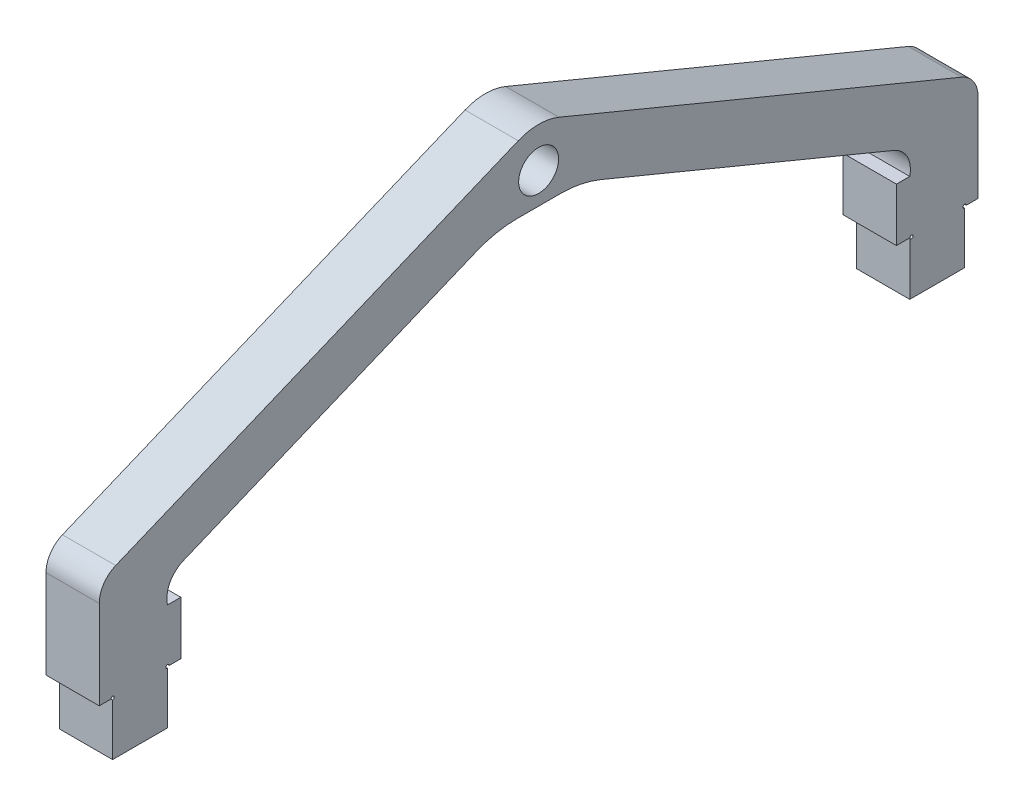
ISO-10303-21;
HEADER;
FILE_DESCRIPTION(('STEP AP214'),'2;1');
FILE_NAME('part.step','',(''),(''),'','','');
FILE_SCHEMA(('AUTOMOTIVE_DESIGN { 1 0 10303 214 1 1 1 1 }'));
ENDSEC;
DATA;
#1=APPLICATION_CONTEXT('core data for automotive mechanical design processes');
#2=APPLICATION_PROTOCOL_DEFINITION('international standard','automotive_design',2000,#1);
#3=PRODUCT_CONTEXT('',#1,'mechanical');
#4=PRODUCT('Part','Part','',(#3));
#5=PRODUCT_RELATED_PRODUCT_CATEGORY('part','',(#4));
#6=PRODUCT_DEFINITION_FORMATION('','',#4);
#7=PRODUCT_DEFINITION_CONTEXT('part definition',#1,'design');
#8=PRODUCT_DEFINITION('design','',#6,#7);
#9=PRODUCT_DEFINITION_SHAPE('','',#8);
#10=(LENGTH_UNIT() NAMED_UNIT(*) SI_UNIT(.MILLI.,.METRE.));
#11=(NAMED_UNIT(*) PLANE_ANGLE_UNIT() SI_UNIT($,.RADIAN.));
#12=(NAMED_UNIT(*) SI_UNIT($,.STERADIAN.) SOLID_ANGLE_UNIT());
#13=UNCERTAINTY_MEASURE_WITH_UNIT(LENGTH_MEASURE(1.E-05),#10,'distance_accuracy_value','');
#14=(GEOMETRIC_REPRESENTATION_CONTEXT(3) GLOBAL_UNCERTAINTY_ASSIGNED_CONTEXT((#13)) GLOBAL_UNIT_ASSIGNED_CONTEXT((#10,
#11,#12)) REPRESENTATION_CONTEXT('',''));
#15=CARTESIAN_POINT('',(0.,0.,0.));
#16=DIRECTION('',(0.,0.,1.));
#17=DIRECTION('',(1.,0.,0.));
#18=AXIS2_PLACEMENT_3D('',#15,#16,#17);
#19=CARTESIAN_POINT('',(6.35,29.3518274111675,-12.1455837563452));
#20=DIRECTION('',(0.,0.924016832421891,-0.3823517927263));
#21=DIRECTION('',(0.,0.3823517927263,0.924016832421891));
#22=AXIS2_PLACEMENT_3D('',#19,#20,#21);
#23=PLANE('',#22);
#24=DIRECTION('',(0.,-0.3823517927263,-0.924016832421891));
#25=VECTOR('',#24,1.);
#26=CARTESIAN_POINT('',(0.,29.3518274111675,-12.1455837563452));
#27=LINE('',#26,#25);
#28=CARTESIAN_POINT('',(0.,33.3729239101468,-2.427933883812));
#29=VERTEX_POINT('',#28);
#30=CARTESIAN_POINT('',(0.,13.5114619550734,-50.426466941906));
#31=VERTEX_POINT('',#30);
#32=EDGE_CURVE('E372',#29,#31,#27,.T.);
#33=ORIENTED_EDGE('',*,*,#32,.F.);
#34=DIRECTION('',(-1.,0.,0.));
#35=VECTOR('',#34,1.);
#36=CARTESIAN_POINT('',(6.35,33.3729239101468,-2.427933883812));
#37=LINE('',#36,#35);
#38=CARTESIAN_POINT('',(6.35,33.3729239101468,-2.427933883812));
#39=VERTEX_POINT('',#38);
#40=EDGE_CURVE('E42',#29,#39,#37,.F.);
#41=ORIENTED_EDGE('',*,*,#40,.T.);
#42=DIRECTION('',(0.,-0.3823517927263,-0.924016832421891));
#43=VECTOR('',#42,1.);
#44=CARTESIAN_POINT('',(6.35,29.3518274111675,-12.1455837563452));
#45=LINE('',#44,#43);
#46=CARTESIAN_POINT('',(6.35,13.5114619550734,-50.426466941906));
#47=VERTEX_POINT('',#46);
#48=EDGE_CURVE('E261',#39,#47,#45,.T.);
#49=ORIENTED_EDGE('',*,*,#48,.T.);
#50=DIRECTION('',(-1.,0.,0.));
#51=VECTOR('',#50,1.);
#52=CARTESIAN_POINT('',(0.,13.5114619550734,-50.426466941906));
#53=LINE('',#52,#51);
#54=EDGE_CURVE('E309',#47,#31,#53,.T.);
#55=ORIENTED_EDGE('',*,*,#54,.T.);
#56=EDGE_LOOP('',(#33,#41,#49,#55));
#57=FACE_BOUND('',#56,.T.);
#58=ADVANCED_FACE('F34',(#57),#23,.T.);
#59=CARTESIAN_POINT('',(6.35,29.3518274111675,12.1455837563452));
#60=DIRECTION('',(0.,0.924016832421891,0.3823517927263));
#61=DIRECTION('',(0.,-0.3823517927263,0.924016832421891));
#62=AXIS2_PLACEMENT_3D('',#59,#60,#61);
#63=PLANE('',#62);
#64=DIRECTION('',(0.,0.3823517927263,-0.924016832421891));
#65=VECTOR('',#64,1.);
#66=CARTESIAN_POINT('',(6.35,29.3518274111675,12.1455837563452));
#67=LINE('',#66,#65);
#68=CARTESIAN_POINT('',(6.35,13.5114619550733,50.426466941906));
#69=VERTEX_POINT('',#68);
#70=CARTESIAN_POINT('',(6.35,33.3729239101468,2.427933883812));
#71=VERTEX_POINT('',#70);
#72=EDGE_CURVE('E367',#69,#71,#67,.T.);
#73=ORIENTED_EDGE('',*,*,#72,.T.);
#74=DIRECTION('',(-1.,0.,0.));
#75=VECTOR('',#74,1.);
#76=CARTESIAN_POINT('',(6.35,33.3729239101468,2.42793388381201));
#77=LINE('',#76,#75);
#78=CARTESIAN_POINT('',(0.,33.3729239101468,2.427933883812));
#79=VERTEX_POINT('',#78);
#80=EDGE_CURVE('E356',#71,#79,#77,.T.);
#81=ORIENTED_EDGE('',*,*,#80,.T.);
#82=DIRECTION('',(0.,0.3823517927263,-0.924016832421891));
#83=VECTOR('',#82,1.);
#84=CARTESIAN_POINT('',(0.,29.3518274111675,12.1455837563452));
#85=LINE('',#84,#83);
#86=CARTESIAN_POINT('',(0.,13.5114619550733,50.426466941906));
#87=VERTEX_POINT('',#86);
#88=EDGE_CURVE('E364',#87,#79,#85,.T.);
#89=ORIENTED_EDGE('',*,*,#88,.F.);
#90=DIRECTION('',(-1.,0.,0.));
#91=VECTOR('',#90,1.);
#92=CARTESIAN_POINT('',(6.35,13.5114619550733,50.426466941906));
#93=LINE('',#92,#91);
#94=EDGE_CURVE('E326',#87,#69,#93,.F.);
#95=ORIENTED_EDGE('',*,*,#94,.T.);
#96=EDGE_LOOP('',(#73,#81,#89,#95));
#97=FACE_BOUND('',#96,.T.);
#98=ADVANCED_FACE('F363',(#97),#63,.T.);
#99=CARTESIAN_POINT('',(6.35,0.,52.3875));
#100=DIRECTION('',(0.,0.,1.));
#101=DIRECTION('',(1.,0.,0.));
#102=AXIS2_PLACEMENT_3D('',#99,#100,#101);
#103=PLANE('',#102);
#104=DIRECTION('',(0.,1.,0.));
#105=VECTOR('',#104,1.);
#106=CARTESIAN_POINT('',(6.35,0.,52.3875));
#107=LINE('',#106,#105);
#108=CARTESIAN_POINT('',(6.35,0.,52.3875));
#109=VERTEX_POINT('',#108);
#110=CARTESIAN_POINT('',(6.35,10.5777085121338,52.3875));
#111=VERTEX_POINT('',#110);
#112=EDGE_CURVE('E519',#109,#111,#107,.T.);
#113=ORIENTED_EDGE('',*,*,#112,.T.);
#114=DIRECTION('',(-1.,0.,0.));
#115=VECTOR('',#114,1.);
#116=CARTESIAN_POINT('',(6.35,10.5777085121338,52.3875));
#117=LINE('',#116,#115);
#118=CARTESIAN_POINT('',(0.,10.5777085121338,52.3875));
#119=VERTEX_POINT('',#118);
#120=EDGE_CURVE('E323',#111,#119,#117,.T.);
#121=ORIENTED_EDGE('',*,*,#120,.T.);
#122=DIRECTION('',(0.,1.,0.));
#123=VECTOR('',#122,1.);
#124=CARTESIAN_POINT('',(0.,0.,52.3875));
#125=LINE('',#124,#123);
#126=CARTESIAN_POINT('',(0.,0.,52.3875));
#127=VERTEX_POINT('',#126);
#128=EDGE_CURVE('E371',#127,#119,#125,.T.);
#129=ORIENTED_EDGE('',*,*,#128,.F.);
#130=DIRECTION('',(-1.,0.,0.));
#131=VECTOR('',#130,1.);
#132=CARTESIAN_POINT('',(6.35,0.,52.3875));
#133=LINE('',#132,#131);
#134=EDGE_CURVE('E299',#109,#127,#133,.T.);
#135=ORIENTED_EDGE('',*,*,#134,.F.);
#136=EDGE_LOOP('',(#113,#121,#129,#135));
#137=FACE_BOUND('',#136,.T.);
#138=ADVANCED_FACE('F571',(#137),#103,.T.);
#139=CARTESIAN_POINT('',(6.35,-4.48275926204392E-13,0.));
#140=DIRECTION('',(0.,-1.,0.));
#141=DIRECTION('',(0.,0.,-1.));
#142=AXIS2_PLACEMENT_3D('',#139,#140,#141);
#143=PLANE('',#142);
#144=DIRECTION('',(1.,0.,0.));
#145=VECTOR('',#144,1.);
#146=CARTESIAN_POINT('',(0.,0.,50.9984375));
#147=LINE('',#146,#145);
#148=CARTESIAN_POINT('',(6.35,0.,50.9984375));
#149=VERTEX_POINT('',#148);
#150=CARTESIAN_POINT('',(0.,0.,50.9984375));
#151=VERTEX_POINT('',#150);
#152=EDGE_CURVE('E376',#149,#151,#147,.F.);
#153=ORIENTED_EDGE('',*,*,#152,.F.);
#154=DIRECTION('',(0.,0.,1.));
#155=VECTOR('',#154,1.);
#156=CARTESIAN_POINT('',(6.35,-4.48275926204392E-13,0.));
#157=LINE('',#156,#155);
#158=EDGE_CURVE('E522',#149,#109,#157,.T.);
#159=ORIENTED_EDGE('',*,*,#158,.T.);
#160=ORIENTED_EDGE('',*,*,#134,.T.);
#161=DIRECTION('',(0.,0.,1.));
#162=VECTOR('',#161,1.);
#163=CARTESIAN_POINT('',(0.,-4.48275926204392E-13,0.));
#164=LINE('',#163,#162);
#165=EDGE_CURVE('E374',#151,#127,#164,.T.);
#166=ORIENTED_EDGE('',*,*,#165,.F.);
#167=EDGE_LOOP('',(#153,#159,#160,#166));
#168=FACE_BOUND('',#167,.T.);
#169=ADVANCED_FACE('F802',(#168),#143,.T.);
#170=CARTESIAN_POINT('',(6.35,0.,50.8));
#171=DIRECTION('',(0.,0.,-1.));
#172=DIRECTION('',(-1.,0.,0.));
#173=AXIS2_PLACEMENT_3D('',#170,#171,#172);
#174=PLANE('',#173);
#175=DIRECTION('',(0.,-1.,0.));
#176=VECTOR('',#175,1.);
#177=CARTESIAN_POINT('',(6.35,0.,50.8));
#178=LINE('',#177,#176);
#179=CARTESIAN_POINT('',(6.35,-0.198437500000019,50.8));
#180=VERTEX_POINT('',#179);
#181=CARTESIAN_POINT('',(6.35,-6.35000000000001,50.8));
#182=VERTEX_POINT('',#181);
#183=EDGE_CURVE('E524',#180,#182,#178,.T.);
#184=ORIENTED_EDGE('',*,*,#183,.F.);
#185=DIRECTION('',(1.,0.,0.));
#186=VECTOR('',#185,1.);
#187=CARTESIAN_POINT('',(0.,-0.198437500000019,50.8));
#188=LINE('',#187,#186);
#189=CARTESIAN_POINT('',(0.,-0.198437500000019,50.8));
#190=VERTEX_POINT('',#189);
#191=EDGE_CURVE('E513',#180,#190,#188,.F.);
#192=ORIENTED_EDGE('',*,*,#191,.T.);
#193=DIRECTION('',(0.,-1.,0.));
#194=VECTOR('',#193,1.);
#195=CARTESIAN_POINT('',(0.,0.,50.8));
#196=LINE('',#195,#194);
#197=CARTESIAN_POINT('',(0.,-6.35000000000001,50.8));
#198=VERTEX_POINT('',#197);
#199=EDGE_CURVE('E381',#190,#198,#196,.T.);
#200=ORIENTED_EDGE('',*,*,#199,.T.);
#201=DIRECTION('',(-1.,0.,0.));
#202=VECTOR('',#201,1.);
#203=CARTESIAN_POINT('',(6.35,-6.35000000000001,50.8));
#204=LINE('',#203,#202);
#205=EDGE_CURVE('E296',#182,#198,#204,.T.);
#206=ORIENTED_EDGE('',*,*,#205,.F.);
#207=EDGE_LOOP('',(#184,#192,#200,#206));
#208=FACE_BOUND('',#207,.T.);
#209=ADVANCED_FACE('F798',(#208),#174,.F.);
#210=CARTESIAN_POINT('',(6.35,-6.34999999999992,0.));
#211=DIRECTION('',(0.,1.,0.));
#212=DIRECTION('',(0.,0.,1.));
#213=AXIS2_PLACEMENT_3D('',#210,#211,#212);
#214=PLANE('',#213);
#215=DIRECTION('',(0.,0.,-1.));
#216=VECTOR('',#215,1.);
#217=CARTESIAN_POINT('',(0.,-6.34999999999992,0.));
#218=LINE('',#217,#216);
#219=CARTESIAN_POINT('',(0.,-6.35,44.25));
#220=VERTEX_POINT('',#219);
#221=EDGE_CURVE('E383',#198,#220,#218,.T.);
#222=ORIENTED_EDGE('',*,*,#221,.T.);
#223=DIRECTION('',(-1.,0.,0.));
#224=VECTOR('',#223,1.);
#225=CARTESIAN_POINT('',(6.35,-6.35,44.25));
#226=LINE('',#225,#224);
#227=CARTESIAN_POINT('',(6.35,-6.35,44.25));
#228=VERTEX_POINT('',#227);
#229=EDGE_CURVE('E293',#228,#220,#226,.T.);
#230=ORIENTED_EDGE('',*,*,#229,.F.);
#231=DIRECTION('',(0.,0.,-1.));
#232=VECTOR('',#231,1.);
#233=CARTESIAN_POINT('',(6.35,-6.34999999999992,0.));
#234=LINE('',#233,#232);
#235=EDGE_CURVE('E526',#182,#228,#234,.T.);
#236=ORIENTED_EDGE('',*,*,#235,.F.);
#237=ORIENTED_EDGE('',*,*,#205,.T.);
#238=EDGE_LOOP('',(#222,#230,#236,#237));
#239=FACE_BOUND('',#238,.T.);
#240=ADVANCED_FACE('F794',(#239),#214,.F.);
#241=CARTESIAN_POINT('',(6.35,0.,44.25));
#242=DIRECTION('',(0.,0.,-1.));
#243=DIRECTION('',(-1.,0.,0.));
#244=AXIS2_PLACEMENT_3D('',#241,#242,#243);
#245=PLANE('',#244);
#246=DIRECTION('',(1.,0.,0.));
#247=VECTOR('',#246,1.);
#248=CARTESIAN_POINT('',(0.,-0.1984375,44.25));
#249=LINE('',#248,#247);
#250=CARTESIAN_POINT('',(6.35,-0.1984375,44.25));
#251=VERTEX_POINT('',#250);
#252=CARTESIAN_POINT('',(0.,-0.1984375,44.25));
#253=VERTEX_POINT('',#252);
#254=EDGE_CURVE('E504',#251,#253,#249,.F.);
#255=ORIENTED_EDGE('',*,*,#254,.F.);
#256=DIRECTION('',(0.,-1.,0.));
#257=VECTOR('',#256,1.);
#258=CARTESIAN_POINT('',(6.35,0.,44.25));
#259=LINE('',#258,#257);
#260=EDGE_CURVE('E529',#251,#228,#259,.T.);
#261=ORIENTED_EDGE('',*,*,#260,.T.);
#262=ORIENTED_EDGE('',*,*,#229,.T.);
#263=DIRECTION('',(0.,-1.,0.));
#264=VECTOR('',#263,1.);
#265=CARTESIAN_POINT('',(0.,0.,44.25));
#266=LINE('',#265,#264);
#267=EDGE_CURVE('E386',#253,#220,#266,.T.);
#268=ORIENTED_EDGE('',*,*,#267,.F.);
#269=EDGE_LOOP('',(#255,#261,#262,#268));
#270=FACE_BOUND('',#269,.T.);
#271=ADVANCED_FACE('F791',(#270),#245,.T.);
#272=CARTESIAN_POINT('',(6.35,0.,0.));
#273=DIRECTION('',(0.,1.,0.));
#274=DIRECTION('',(0.,0.,1.));
#275=AXIS2_PLACEMENT_3D('',#272,#273,#274);
#276=PLANE('',#275);
#277=DIRECTION('',(0.,0.,-1.));
#278=VECTOR('',#277,1.);
#279=CARTESIAN_POINT('',(6.35,0.,0.));
#280=LINE('',#279,#278);
#281=CARTESIAN_POINT('',(6.35,0.,44.0515625));
#282=VERTEX_POINT('',#281);
#283=CARTESIAN_POINT('',(6.35,0.,42.6625));
#284=VERTEX_POINT('',#283);
#285=EDGE_CURVE('E501',#282,#284,#280,.T.);
#286=ORIENTED_EDGE('',*,*,#285,.F.);
#287=DIRECTION('',(1.,0.,0.));
#288=VECTOR('',#287,1.);
#289=CARTESIAN_POINT('',(0.,0.,44.0515625));
#290=LINE('',#289,#288);
#291=CARTESIAN_POINT('',(0.,0.,44.0515625));
#292=VERTEX_POINT('',#291);
#293=EDGE_CURVE('E500',#282,#292,#290,.F.);
#294=ORIENTED_EDGE('',*,*,#293,.T.);
#295=DIRECTION('',(0.,0.,-1.));
#296=VECTOR('',#295,1.);
#297=CARTESIAN_POINT('',(0.,0.,0.));
#298=LINE('',#297,#296);
#299=CARTESIAN_POINT('',(0.,0.,42.6625));
#300=VERTEX_POINT('',#299);
#301=EDGE_CURVE('E388',#292,#300,#298,.T.);
#302=ORIENTED_EDGE('',*,*,#301,.T.);
#303=DIRECTION('',(-1.,0.,0.));
#304=VECTOR('',#303,1.);
#305=CARTESIAN_POINT('',(6.35,0.,42.6625));
#306=LINE('',#305,#304);
#307=EDGE_CURVE('E290',#284,#300,#306,.T.);
#308=ORIENTED_EDGE('',*,*,#307,.F.);
#309=EDGE_LOOP('',(#286,#294,#302,#308));
#310=FACE_BOUND('',#309,.T.);
#311=ADVANCED_FACE('F499',(#310),#276,.F.);
#312=CARTESIAN_POINT('',(6.35,0.,42.6625));
#313=DIRECTION('',(0.,0.,1.));
#314=DIRECTION('',(1.,0.,0.));
#315=AXIS2_PLACEMENT_3D('',#312,#313,#314);
#316=PLANE('',#315);
#317=DIRECTION('',(0.,1.,0.));
#318=VECTOR('',#317,1.);
#319=CARTESIAN_POINT('',(0.,0.,42.6625));
#320=LINE('',#319,#318);
#321=CARTESIAN_POINT('',(0.,6.35,42.6625));
#322=VERTEX_POINT('',#321);
#323=EDGE_CURVE('E390',#300,#322,#320,.T.);
#324=ORIENTED_EDGE('',*,*,#323,.T.);
#325=DIRECTION('',(-1.,0.,0.));
#326=VECTOR('',#325,1.);
#327=CARTESIAN_POINT('',(6.35,6.35,42.6625));
#328=LINE('',#327,#326);
#329=CARTESIAN_POINT('',(6.35,6.35,42.6625));
#330=VERTEX_POINT('',#329);
#331=EDGE_CURVE('E288',#330,#322,#328,.T.);
#332=ORIENTED_EDGE('',*,*,#331,.F.);
#333=DIRECTION('',(0.,1.,0.));
#334=VECTOR('',#333,1.);
#335=CARTESIAN_POINT('',(6.35,0.,42.6625));
#336=LINE('',#335,#334);
#337=EDGE_CURVE('E532',#284,#330,#336,.T.);
#338=ORIENTED_EDGE('',*,*,#337,.F.);
#339=ORIENTED_EDGE('',*,*,#307,.T.);
#340=EDGE_LOOP('',(#324,#332,#338,#339));
#341=FACE_BOUND('',#340,.T.);
#342=ADVANCED_FACE('F490',(#341),#316,.F.);
#343=CARTESIAN_POINT('',(6.35,6.35,0.));
#344=DIRECTION('',(0.,1.,0.));
#345=DIRECTION('',(0.,0.,1.));
#346=AXIS2_PLACEMENT_3D('',#343,#344,#345);
#347=PLANE('',#346);
#348=DIRECTION('',(0.,0.,-1.));
#349=VECTOR('',#348,1.);
#350=CARTESIAN_POINT('',(0.,6.35,0.));
#351=LINE('',#350,#349);
#352=CARTESIAN_POINT('',(0.,6.35,44.25));
#353=VERTEX_POINT('',#352);
#354=EDGE_CURVE('E393',#353,#322,#351,.T.);
#355=ORIENTED_EDGE('',*,*,#354,.F.);
#356=DIRECTION('',(-1.,0.,0.));
#357=VECTOR('',#356,1.);
#358=CARTESIAN_POINT('',(6.35,6.35,44.25));
#359=LINE('',#358,#357);
#360=CARTESIAN_POINT('',(6.35,6.35,44.25));
#361=VERTEX_POINT('',#360);
#362=EDGE_CURVE('E285',#361,#353,#359,.T.);
#363=ORIENTED_EDGE('',*,*,#362,.F.);
#364=DIRECTION('',(0.,0.,-1.));
#365=VECTOR('',#364,1.);
#366=CARTESIAN_POINT('',(6.35,6.35,0.));
#367=LINE('',#366,#365);
#368=EDGE_CURVE('E487',#361,#330,#367,.T.);
#369=ORIENTED_EDGE('',*,*,#368,.T.);
#370=ORIENTED_EDGE('',*,*,#331,.T.);
#371=EDGE_LOOP('',(#355,#363,#369,#370));
#372=FACE_BOUND('',#371,.T.);
#373=ADVANCED_FACE('F483',(#372),#347,.T.);
#374=CARTESIAN_POINT('',(6.35,23.4843205252885,9.71764987253318));
#375=DIRECTION('',(0.,-0.924016832421891,-0.3823517927263));
#376=DIRECTION('',(0.,0.3823517927263,-0.924016832421891));
#377=AXIS2_PLACEMENT_3D('',#374,#375,#376);
#378=PLANE('',#377);
#379=DIRECTION('',(0.,-0.3823517927263,0.924016832421891));
#380=VECTOR('',#379,1.);
#381=CARTESIAN_POINT('',(0.,23.4843205252885,9.71764987253318));
#382=LINE('',#381,#380);
#383=CARTESIAN_POINT('',(0.,24.435013771758,7.4201411935652));
#384=VERTEX_POINT('',#383);
#385=CARTESIAN_POINT('',(0.,9.97501763107532,42.3651318668817));
#386=VERTEX_POINT('',#385);
#387=EDGE_CURVE('E396',#384,#386,#382,.T.);
#388=ORIENTED_EDGE('',*,*,#387,.F.);
#389=DIRECTION('',(-1.,0.,0.));
#390=VECTOR('',#389,1.);
#391=CARTESIAN_POINT('',(6.35,24.435013771758,7.4201411935652));
#392=LINE('',#391,#390);
#393=CARTESIAN_POINT('',(6.35,24.435013771758,7.4201411935652));
#394=VERTEX_POINT('',#393);
#395=EDGE_CURVE('E343',#384,#394,#392,.F.);
#396=ORIENTED_EDGE('',*,*,#395,.T.);
#397=DIRECTION('',(0.,-0.3823517927263,0.924016832421891));
#398=VECTOR('',#397,1.);
#399=CARTESIAN_POINT('',(6.35,23.4843205252885,9.71764987253318));
#400=LINE('',#399,#398);
#401=CARTESIAN_POINT('',(6.35,9.97501763107532,42.3651318668817));
#402=VERTEX_POINT('',#401);
#403=EDGE_CURVE('E476',#394,#402,#400,.T.);
#404=ORIENTED_EDGE('',*,*,#403,.T.);
#405=DIRECTION('',(1.,0.,0.));
#406=VECTOR('',#405,1.);
#407=CARTESIAN_POINT('',(0.,9.97501763107532,42.3651318668817));
#408=LINE('',#407,#406);
#409=EDGE_CURVE('E243',#402,#386,#408,.F.);
#410=ORIENTED_EDGE('',*,*,#409,.T.);
#411=EDGE_LOOP('',(#388,#396,#404,#410));
#412=FACE_BOUND('',#411,.T.);
#413=ADVANCED_FACE('F473',(#412),#378,.T.);
#414=CARTESIAN_POINT('',(6.35,25.4,0.));
#415=DIRECTION('',(0.,-1.,0.));
#416=DIRECTION('',(0.,0.,-1.));
#417=AXIS2_PLACEMENT_3D('',#414,#415,#416);
#418=PLANE('',#417);
#419=DIRECTION('',(0.,0.,1.));
#420=VECTOR('',#419,1.);
#421=CARTESIAN_POINT('',(6.35,25.4,0.));
#422=LINE('',#421,#420);
#423=CARTESIAN_POINT('',(6.35,25.4,-2.56427342594119));
#424=VERTEX_POINT('',#423);
#425=CARTESIAN_POINT('',(6.35,25.4,2.56427342594119));
#426=VERTEX_POINT('',#425);
#427=EDGE_CURVE('E465',#424,#426,#422,.T.);
#428=ORIENTED_EDGE('',*,*,#427,.T.);
#429=DIRECTION('',(-1.,0.,0.));
#430=VECTOR('',#429,1.);
#431=CARTESIAN_POINT('',(0.,25.4,2.56427342594119));
#432=LINE('',#431,#430);
#433=CARTESIAN_POINT('',(0.,25.4,2.56427342594119));
#434=VERTEX_POINT('',#433);
#435=EDGE_CURVE('E340',#426,#434,#432,.T.);
#436=ORIENTED_EDGE('',*,*,#435,.T.);
#437=DIRECTION('',(0.,0.,1.));
#438=VECTOR('',#437,1.);
#439=CARTESIAN_POINT('',(0.,25.4,0.));
#440=LINE('',#439,#438);
#441=CARTESIAN_POINT('',(0.,25.4,-2.56427342594119));
#442=VERTEX_POINT('',#441);
#443=EDGE_CURVE('E398',#442,#434,#440,.T.);
#444=ORIENTED_EDGE('',*,*,#443,.F.);
#445=DIRECTION('',(-1.,0.,0.));
#446=VECTOR('',#445,1.);
#447=CARTESIAN_POINT('',(6.35,25.4,-2.56427342594119));
#448=LINE('',#447,#446);
#449=EDGE_CURVE('E338',#442,#424,#448,.F.);
#450=ORIENTED_EDGE('',*,*,#449,.T.);
#451=EDGE_LOOP('',(#428,#436,#444,#450));
#452=FACE_BOUND('',#451,.T.);
#453=ADVANCED_FACE('F462',(#452),#418,.T.);
#454=CARTESIAN_POINT('',(6.35,23.4843205252885,-9.71764987253318));
#455=DIRECTION('',(0.,0.924016832421891,-0.3823517927263));
#456=DIRECTION('',(0.,0.3823517927263,0.924016832421891));
#457=AXIS2_PLACEMENT_3D('',#454,#455,#456);
#458=PLANE('',#457);
#459=DIRECTION('',(0.,-0.3823517927263,-0.924016832421891));
#460=VECTOR('',#459,1.);
#461=CARTESIAN_POINT('',(6.35,23.4843205252885,-9.71764987253318));
#462=LINE('',#461,#460);
#463=CARTESIAN_POINT('',(6.35,24.435013771758,-7.4201411935652));
#464=VERTEX_POINT('',#463);
#465=CARTESIAN_POINT('',(6.35,9.97501763107533,-42.3651318668817));
#466=VERTEX_POINT('',#465);
#467=EDGE_CURVE('E453',#464,#466,#462,.T.);
#468=ORIENTED_EDGE('',*,*,#467,.F.);
#469=DIRECTION('',(-1.,0.,0.));
#470=VECTOR('',#469,1.);
#471=CARTESIAN_POINT('',(6.35,24.435013771758,-7.4201411935652));
#472=LINE('',#471,#470);
#473=CARTESIAN_POINT('',(0.,24.435013771758,-7.4201411935652));
#474=VERTEX_POINT('',#473);
#475=EDGE_CURVE('E345',#464,#474,#472,.T.);
#476=ORIENTED_EDGE('',*,*,#475,.T.);
#477=DIRECTION('',(0.,-0.3823517927263,-0.924016832421891));
#478=VECTOR('',#477,1.);
#479=CARTESIAN_POINT('',(0.,23.4843205252885,-9.71764987253318));
#480=LINE('',#479,#478);
#481=CARTESIAN_POINT('',(0.,9.97501763107533,-42.3651318668817));
#482=VERTEX_POINT('',#481);
#483=EDGE_CURVE('E401',#474,#482,#480,.T.);
#484=ORIENTED_EDGE('',*,*,#483,.T.);
#485=DIRECTION('',(-1.,0.,0.));
#486=VECTOR('',#485,1.);
#487=CARTESIAN_POINT('',(6.35,9.97501763107533,-42.3651318668817));
#488=LINE('',#487,#486);
#489=EDGE_CURVE('E306',#482,#466,#488,.F.);
#490=ORIENTED_EDGE('',*,*,#489,.T.);
#491=EDGE_LOOP('',(#468,#476,#484,#490));
#492=FACE_BOUND('',#491,.T.);
#493=ADVANCED_FACE('F452',(#492),#458,.F.);
#494=CARTESIAN_POINT('',(6.35,6.35,0.));
#495=DIRECTION('',(0.,1.,0.));
#496=DIRECTION('',(0.,0.,1.));
#497=AXIS2_PLACEMENT_3D('',#494,#495,#496);
#498=PLANE('',#497);
#499=DIRECTION('',(0.,0.,-1.));
#500=VECTOR('',#499,1.);
#501=CARTESIAN_POINT('',(0.,6.35,0.));
#502=LINE('',#501,#500);
#503=CARTESIAN_POINT('',(0.,6.35,-42.6625));
#504=VERTEX_POINT('',#503);
#505=CARTESIAN_POINT('',(0.,6.35000000000001,-44.25));
#506=VERTEX_POINT('',#505);
#507=EDGE_CURVE('E403',#504,#506,#502,.T.);
#508=ORIENTED_EDGE('',*,*,#507,.F.);
#509=DIRECTION('',(-1.,0.,0.));
#510=VECTOR('',#509,1.);
#511=CARTESIAN_POINT('',(6.35,6.35,-42.6625));
#512=LINE('',#511,#510);
#513=CARTESIAN_POINT('',(6.35,6.35,-42.6625));
#514=VERTEX_POINT('',#513);
#515=EDGE_CURVE('E280',#514,#504,#512,.T.);
#516=ORIENTED_EDGE('',*,*,#515,.F.);
#517=DIRECTION('',(0.,0.,-1.));
#518=VECTOR('',#517,1.);
#519=CARTESIAN_POINT('',(6.35,6.35,0.));
#520=LINE('',#519,#518);
#521=CARTESIAN_POINT('',(6.35,6.35000000000001,-44.25));
#522=VERTEX_POINT('',#521);
#523=EDGE_CURVE('E538',#514,#522,#520,.T.);
#524=ORIENTED_EDGE('',*,*,#523,.T.);
#525=DIRECTION('',(-1.,0.,0.));
#526=VECTOR('',#525,1.);
#527=CARTESIAN_POINT('',(6.35,6.35000000000001,-44.25));
#528=LINE('',#527,#526);
#529=EDGE_CURVE('E282',#522,#506,#528,.T.);
#530=ORIENTED_EDGE('',*,*,#529,.T.);
#531=EDGE_LOOP('',(#508,#516,#524,#530));
#532=FACE_BOUND('',#531,.T.);
#533=ADVANCED_FACE('F443',(#532),#498,.T.);
#534=CARTESIAN_POINT('',(6.35,0.,-42.6625));
#535=DIRECTION('',(0.,0.,1.));
#536=DIRECTION('',(1.,0.,0.));
#537=AXIS2_PLACEMENT_3D('',#534,#535,#536);
#538=PLANE('',#537);
#539=DIRECTION('',(0.,1.,0.));
#540=VECTOR('',#539,1.);
#541=CARTESIAN_POINT('',(0.,0.,-42.6625));
#542=LINE('',#541,#540);
#543=CARTESIAN_POINT('',(0.,0.,-42.6625));
#544=VERTEX_POINT('',#543);
#545=EDGE_CURVE('E406',#544,#504,#542,.T.);
#546=ORIENTED_EDGE('',*,*,#545,.F.);
#547=DIRECTION('',(-1.,0.,0.));
#548=VECTOR('',#547,1.);
#549=CARTESIAN_POINT('',(6.35,0.,-42.6625));
#550=LINE('',#549,#548);
#551=CARTESIAN_POINT('',(6.35,0.,-42.6625));
#552=VERTEX_POINT('',#551);
#553=EDGE_CURVE('E278',#552,#544,#550,.T.);
#554=ORIENTED_EDGE('',*,*,#553,.F.);
#555=DIRECTION('',(0.,1.,0.));
#556=VECTOR('',#555,1.);
#557=CARTESIAN_POINT('',(6.35,0.,-42.6625));
#558=LINE('',#557,#556);
#559=EDGE_CURVE('E439',#552,#514,#558,.T.);
#560=ORIENTED_EDGE('',*,*,#559,.T.);
#561=ORIENTED_EDGE('',*,*,#515,.T.);
#562=EDGE_LOOP('',(#546,#554,#560,#561));
#563=FACE_BOUND('',#562,.T.);
#564=ADVANCED_FACE('F436',(#563),#538,.T.);
#565=CARTESIAN_POINT('',(6.35,0.,0.));
#566=DIRECTION('',(0.,1.,0.));
#567=DIRECTION('',(0.,0.,1.));
#568=AXIS2_PLACEMENT_3D('',#565,#566,#567);
#569=PLANE('',#568);
#570=DIRECTION('',(0.,0.,-1.));
#571=VECTOR('',#570,1.);
#572=CARTESIAN_POINT('',(0.,0.,0.));
#573=LINE('',#572,#571);
#574=CARTESIAN_POINT('',(0.,0.,-44.25));
#575=VERTEX_POINT('',#574);
#576=EDGE_CURVE('E409',#544,#575,#573,.T.);
#577=ORIENTED_EDGE('',*,*,#576,.T.);
#578=DIRECTION('',(-1.,0.,0.));
#579=VECTOR('',#578,1.);
#580=CARTESIAN_POINT('',(6.35,0.,-44.25));
#581=LINE('',#580,#579);
#582=CARTESIAN_POINT('',(6.35,0.,-44.25));
#583=VERTEX_POINT('',#582);
#584=EDGE_CURVE('E275',#583,#575,#581,.T.);
#585=ORIENTED_EDGE('',*,*,#584,.F.);
#586=DIRECTION('',(0.,0.,-1.));
#587=VECTOR('',#586,1.);
#588=CARTESIAN_POINT('',(6.35,0.,0.));
#589=LINE('',#588,#587);
#590=EDGE_CURVE('E432',#552,#583,#589,.T.);
#591=ORIENTED_EDGE('',*,*,#590,.F.);
#592=ORIENTED_EDGE('',*,*,#553,.T.);
#593=EDGE_LOOP('',(#577,#585,#591,#592));
#594=FACE_BOUND('',#593,.T.);
#595=ADVANCED_FACE('F431',(#594),#569,.F.);
#596=CARTESIAN_POINT('',(6.35,0.,-44.25));
#597=DIRECTION('',(0.,0.,-1.));
#598=DIRECTION('',(-1.,0.,0.));
#599=AXIS2_PLACEMENT_3D('',#596,#597,#598);
#600=PLANE('',#599);
#601=DIRECTION('',(0.,-1.,0.));
#602=VECTOR('',#601,1.);
#603=CARTESIAN_POINT('',(0.,0.,-44.25));
#604=LINE('',#603,#602);
#605=CARTESIAN_POINT('',(0.,-6.35,-44.25));
#606=VERTEX_POINT('',#605);
#607=EDGE_CURVE('E411',#575,#606,#604,.T.);
#608=ORIENTED_EDGE('',*,*,#607,.T.);
#609=DIRECTION('',(-1.,0.,0.));
#610=VECTOR('',#609,1.);
#611=CARTESIAN_POINT('',(6.35,-6.35,-44.25));
#612=LINE('',#611,#610);
#613=CARTESIAN_POINT('',(6.35,-6.35,-44.25));
#614=VERTEX_POINT('',#613);
#615=EDGE_CURVE('E273',#614,#606,#612,.T.);
#616=ORIENTED_EDGE('',*,*,#615,.F.);
#617=DIRECTION('',(0.,-1.,0.));
#618=VECTOR('',#617,1.);
#619=CARTESIAN_POINT('',(6.35,0.,-44.25));
#620=LINE('',#619,#618);
#621=EDGE_CURVE('E428',#583,#614,#620,.T.);
#622=ORIENTED_EDGE('',*,*,#621,.F.);
#623=ORIENTED_EDGE('',*,*,#584,.T.);
#624=EDGE_LOOP('',(#608,#616,#622,#623));
#625=FACE_BOUND('',#624,.T.);
#626=ADVANCED_FACE('F426',(#625),#600,.F.);
#627=CARTESIAN_POINT('',(6.35,-6.34999999999992,0.));
#628=DIRECTION('',(0.,-1.,0.));
#629=DIRECTION('',(0.,0.,-1.));
#630=AXIS2_PLACEMENT_3D('',#627,#628,#629);
#631=PLANE('',#630);
#632=DIRECTION('',(0.,0.,1.));
#633=VECTOR('',#632,1.);
#634=CARTESIAN_POINT('',(0.,-6.34999999999992,0.));
#635=LINE('',#634,#633);
#636=CARTESIAN_POINT('',(0.,-6.35000000000001,-50.8));
#637=VERTEX_POINT('',#636);
#638=EDGE_CURVE('E263',#637,#606,#635,.T.);
#639=ORIENTED_EDGE('',*,*,#638,.F.);
#640=DIRECTION('',(-1.,0.,0.));
#641=VECTOR('',#640,1.);
#642=CARTESIAN_POINT('',(6.35,-6.35000000000001,-50.8));
#643=LINE('',#642,#641);
#644=CARTESIAN_POINT('',(6.35,-6.35000000000001,-50.8));
#645=VERTEX_POINT('',#644);
#646=EDGE_CURVE('E269',#645,#637,#643,.T.);
#647=ORIENTED_EDGE('',*,*,#646,.F.);
#648=DIRECTION('',(0.,0.,1.));
#649=VECTOR('',#648,1.);
#650=CARTESIAN_POINT('',(6.35,-6.34999999999992,0.));
#651=LINE('',#650,#649);
#652=EDGE_CURVE('E423',#645,#614,#651,.T.);
#653=ORIENTED_EDGE('',*,*,#652,.T.);
#654=ORIENTED_EDGE('',*,*,#615,.T.);
#655=EDGE_LOOP('',(#639,#647,#653,#654));
#656=FACE_BOUND('',#655,.T.);
#657=ADVANCED_FACE('F419',(#656),#631,.T.);
#658=CARTESIAN_POINT('',(6.35,0.,-50.8));
#659=DIRECTION('',(0.,0.,-1.));
#660=DIRECTION('',(-1.,0.,0.));
#661=AXIS2_PLACEMENT_3D('',#658,#659,#660);
#662=PLANE('',#661);
#663=DIRECTION('',(1.,0.,0.));
#664=VECTOR('',#663,1.);
#665=CARTESIAN_POINT('',(0.,-0.198437500000019,-50.8));
#666=LINE('',#665,#664);
#667=CARTESIAN_POINT('',(6.35,-0.198437500000019,-50.8));
#668=VERTEX_POINT('',#667);
#669=CARTESIAN_POINT('',(0.,-0.198437500000019,-50.8));
#670=VERTEX_POINT('',#669);
#671=EDGE_CURVE('E240',#668,#670,#666,.F.);
#672=ORIENTED_EDGE('',*,*,#671,.F.);
#673=DIRECTION('',(0.,-1.,0.));
#674=VECTOR('',#673,1.);
#675=CARTESIAN_POINT('',(6.35,0.,-50.8));
#676=LINE('',#675,#674);
#677=EDGE_CURVE('E544',#668,#645,#676,.T.);
#678=ORIENTED_EDGE('',*,*,#677,.T.);
#679=ORIENTED_EDGE('',*,*,#646,.T.);
#680=DIRECTION('',(0.,-1.,0.));
#681=VECTOR('',#680,1.);
#682=CARTESIAN_POINT('',(0.,0.,-50.8));
#683=LINE('',#682,#681);
#684=EDGE_CURVE('E259',#670,#637,#683,.T.);
#685=ORIENTED_EDGE('',*,*,#684,.F.);
#686=EDGE_LOOP('',(#672,#678,#679,#685));
#687=FACE_BOUND('',#686,.T.);
#688=ADVANCED_FACE('F749',(#687),#662,.T.);
#689=CARTESIAN_POINT('',(6.35,5.7822302084092E-13,0.));
#690=DIRECTION('',(0.,1.,0.));
#691=DIRECTION('',(0.,0.,1.));
#692=AXIS2_PLACEMENT_3D('',#689,#690,#691);
#693=PLANE('',#692);
#694=DIRECTION('',(0.,0.,-1.));
#695=VECTOR('',#694,1.);
#696=CARTESIAN_POINT('',(6.35,5.7822302084092E-13,0.));
#697=LINE('',#696,#695);
#698=CARTESIAN_POINT('',(6.35,0.,-50.9984375));
#699=VERTEX_POINT('',#698);
#700=CARTESIAN_POINT('',(6.35,0.,-52.3875));
#701=VERTEX_POINT('',#700);
#702=EDGE_CURVE('E252',#699,#701,#697,.T.);
#703=ORIENTED_EDGE('',*,*,#702,.F.);
#704=DIRECTION('',(1.,0.,0.));
#705=VECTOR('',#704,1.);
#706=CARTESIAN_POINT('',(0.,0.,-50.9984375));
#707=LINE('',#706,#705);
#708=CARTESIAN_POINT('',(0.,0.,-50.9984375));
#709=VERTEX_POINT('',#708);
#710=EDGE_CURVE('E237',#699,#709,#707,.F.);
#711=ORIENTED_EDGE('',*,*,#710,.T.);
#712=DIRECTION('',(0.,0.,-1.));
#713=VECTOR('',#712,1.);
#714=CARTESIAN_POINT('',(0.,5.7822302084092E-13,0.));
#715=LINE('',#714,#713);
#716=CARTESIAN_POINT('',(0.,0.,-52.3875));
#717=VERTEX_POINT('',#716);
#718=EDGE_CURVE('E250',#709,#717,#715,.T.);
#719=ORIENTED_EDGE('',*,*,#718,.T.);
#720=DIRECTION('',(-1.,0.,0.));
#721=VECTOR('',#720,1.);
#722=CARTESIAN_POINT('',(6.35,0.,-52.3875));
#723=LINE('',#722,#721);
#724=EDGE_CURVE('E267',#701,#717,#723,.T.);
#725=ORIENTED_EDGE('',*,*,#724,.F.);
#726=EDGE_LOOP('',(#703,#711,#719,#725));
#727=FACE_BOUND('',#726,.T.);
#728=ADVANCED_FACE('F248',(#727),#693,.F.);
#729=CARTESIAN_POINT('',(6.35,0.,-52.3875));
#730=DIRECTION('',(0.,0.,1.));
#731=DIRECTION('',(1.,0.,0.));
#732=AXIS2_PLACEMENT_3D('',#729,#730,#731);
#733=PLANE('',#732);
#734=DIRECTION('',(0.,1.,0.));
#735=VECTOR('',#734,1.);
#736=CARTESIAN_POINT('',(0.,0.,-52.3875));
#737=LINE('',#736,#735);
#738=CARTESIAN_POINT('',(0.,10.5777085121339,-52.3875));
#739=VERTEX_POINT('',#738);
#740=EDGE_CURVE('E258',#717,#739,#737,.T.);
#741=ORIENTED_EDGE('',*,*,#740,.T.);
#742=DIRECTION('',(-1.,0.,0.));
#743=VECTOR('',#742,1.);
#744=CARTESIAN_POINT('',(6.35,10.5777085121339,-52.3875));
#745=LINE('',#744,#743);
#746=CARTESIAN_POINT('',(6.35,10.5777085121339,-52.3875));
#747=VERTEX_POINT('',#746);
#748=EDGE_CURVE('E316',#739,#747,#745,.F.);
#749=ORIENTED_EDGE('',*,*,#748,.T.);
#750=DIRECTION('',(0.,1.,0.));
#751=VECTOR('',#750,1.);
#752=CARTESIAN_POINT('',(6.35,0.,-52.3875));
#753=LINE('',#752,#751);
#754=EDGE_CURVE('E270',#701,#747,#753,.T.);
#755=ORIENTED_EDGE('',*,*,#754,.F.);
#756=ORIENTED_EDGE('',*,*,#724,.T.);
#757=EDGE_LOOP('',(#741,#749,#755,#756));
#758=FACE_BOUND('',#757,.T.);
#759=ADVANCED_FACE('F623',(#758),#733,.F.);
#760=CARTESIAN_POINT('',(6.35,0.,0.));
#761=DIRECTION('',(1.,0.,0.));
#762=DIRECTION('',(0.,0.,-1.));
#763=AXIS2_PLACEMENT_3D('',#760,#761,#762);
#764=PLANE('',#763);
#765=CARTESIAN_POINT('',(6.35,29.0929170242677,0.));
#766=DIRECTION('',(1.,0.,0.));
#767=DIRECTION('',(0.,0.,-1.));
#768=AXIS2_PLACEMENT_3D('',#765,#766,#767);
#769=CIRCLE('',#768,2.38125);
#770=CARTESIAN_POINT('',(6.35,29.0929170242677,-2.38125));
#771=VERTEX_POINT('',#770);
#772=EDGE_CURVE('E837',#771,#771,#769,.T.);
#773=ORIENTED_EDGE('',*,*,#772,.F.);
#774=EDGE_LOOP('',(#773));
#775=FACE_BOUND('',#774,.T.);
#776=ORIENTED_EDGE('',*,*,#48,.F.);
#777=CARTESIAN_POINT('',(6.35,27.5054170242678,0.));
#778=DIRECTION('',(1.,0.,0.));
#779=DIRECTION('',(0.,0.,-1.));
#780=AXIS2_PLACEMENT_3D('',#777,#778,#779);
#781=CIRCLE('',#780,6.35);
#782=EDGE_CURVE('E11',#39,#71,#781,.T.);
#783=ORIENTED_EDGE('',*,*,#782,.T.);
#784=ORIENTED_EDGE('',*,*,#72,.F.);
#785=CARTESIAN_POINT('',(6.35,10.5777085121338,49.2125));
#786=DIRECTION('',(1.,0.,0.));
#787=DIRECTION('',(0.,0.,-1.));
#788=AXIS2_PLACEMENT_3D('',#785,#786,#787);
#789=CIRCLE('',#788,3.175);
#790=EDGE_CURVE('E318',#69,#111,#789,.T.);
#791=ORIENTED_EDGE('',*,*,#790,.T.);
#792=ORIENTED_EDGE('',*,*,#112,.F.);
#793=ORIENTED_EDGE('',*,*,#158,.F.);
#794=CARTESIAN_POINT('',(6.35,0.,50.8));
#795=DIRECTION('',(1.,0.,0.));
#796=DIRECTION('',(0.,0.,-1.));
#797=AXIS2_PLACEMENT_3D('',#794,#795,#796);
#798=CIRCLE('',#797,0.198437500000005);
#799=EDGE_CURVE('E506',#180,#149,#798,.T.);
#800=ORIENTED_EDGE('',*,*,#799,.F.);
#801=ORIENTED_EDGE('',*,*,#183,.T.);
#802=ORIENTED_EDGE('',*,*,#235,.T.);
#803=ORIENTED_EDGE('',*,*,#260,.F.);
#804=CARTESIAN_POINT('',(6.35,0.,44.25));
#805=DIRECTION('',(1.,0.,0.));
#806=DIRECTION('',(0.,0.,-1.));
#807=AXIS2_PLACEMENT_3D('',#804,#805,#806);
#808=CIRCLE('',#807,0.198437500000005);
#809=EDGE_CURVE('E508',#282,#251,#808,.T.);
#810=ORIENTED_EDGE('',*,*,#809,.F.);
#811=ORIENTED_EDGE('',*,*,#285,.T.);
#812=ORIENTED_EDGE('',*,*,#337,.T.);
#813=ORIENTED_EDGE('',*,*,#368,.F.);
#814=CARTESIAN_POINT('',(6.35,7.04126418813582,41.1511649249757));
#815=DIRECTION('',(1.,0.,0.));
#816=DIRECTION('',(0.,0.,-1.));
#817=AXIS2_PLACEMENT_3D('',#814,#815,#816);
#818=CIRCLE('',#817,3.175);
#819=EDGE_CURVE('E330',#361,#402,#818,.F.);
#820=ORIENTED_EDGE('',*,*,#819,.T.);
#821=ORIENTED_EDGE('',*,*,#403,.F.);
#822=CARTESIAN_POINT('',(6.35,12.7,2.56427342594119));
#823=DIRECTION('',(1.,0.,0.));
#824=DIRECTION('',(0.,0.,-1.));
#825=AXIS2_PLACEMENT_3D('',#822,#823,#824);
#826=CIRCLE('',#825,12.7);
#827=EDGE_CURVE('E350',#394,#426,#826,.F.);
#828=ORIENTED_EDGE('',*,*,#827,.T.);
#829=ORIENTED_EDGE('',*,*,#427,.F.);
#830=CARTESIAN_POINT('',(6.35,12.7,-2.56427342594119));
#831=DIRECTION('',(1.,0.,0.));
#832=DIRECTION('',(0.,0.,-1.));
#833=AXIS2_PLACEMENT_3D('',#830,#831,#832);
#834=CIRCLE('',#833,12.7);
#835=EDGE_CURVE('E354',#424,#464,#834,.F.);
#836=ORIENTED_EDGE('',*,*,#835,.T.);
#837=ORIENTED_EDGE('',*,*,#467,.T.);
#838=CARTESIAN_POINT('',(6.35,7.04126418813583,-41.1511649249757));
#839=DIRECTION('',(1.,0.,0.));
#840=DIRECTION('',(0.,0.,-1.));
#841=AXIS2_PLACEMENT_3D('',#838,#839,#840);
#842=CIRCLE('',#841,3.175);
#843=EDGE_CURVE('E336',#466,#522,#842,.F.);
#844=ORIENTED_EDGE('',*,*,#843,.T.);
#845=ORIENTED_EDGE('',*,*,#523,.F.);
#846=ORIENTED_EDGE('',*,*,#559,.F.);
#847=ORIENTED_EDGE('',*,*,#590,.T.);
#848=ORIENTED_EDGE('',*,*,#621,.T.);
#849=ORIENTED_EDGE('',*,*,#652,.F.);
#850=ORIENTED_EDGE('',*,*,#677,.F.);
#851=CARTESIAN_POINT('',(6.35,0.,-50.8));
#852=DIRECTION('',(1.,0.,0.));
#853=DIRECTION('',(0.,0.,1.));
#854=AXIS2_PLACEMENT_3D('',#851,#852,#853);
#855=CIRCLE('',#854,0.198437500000005);
#856=EDGE_CURVE('E253',#699,#668,#855,.T.);
#857=ORIENTED_EDGE('',*,*,#856,.F.);
#858=ORIENTED_EDGE('',*,*,#702,.T.);
#859=ORIENTED_EDGE('',*,*,#754,.T.);
#860=CARTESIAN_POINT('',(6.35,10.5777085121339,-49.2125));
#861=DIRECTION('',(1.,0.,0.));
#862=DIRECTION('',(0.,0.,-1.));
#863=AXIS2_PLACEMENT_3D('',#860,#861,#862);
#864=CIRCLE('',#863,3.175);
#865=EDGE_CURVE('E320',#747,#47,#864,.T.);
#866=ORIENTED_EDGE('',*,*,#865,.T.);
#867=EDGE_LOOP('',(#776,#783,#784,#791,#792,#793,#800,#801,#802,#803,#810,#811,#812,#813,#820,
#821,#828,#829,#836,#837,#844,#845,#846,#847,#848,#849,#850,#857,#858,#859,#866));
#868=FACE_BOUND('',#867,.T.);
#869=CARTESIAN_POINT('',(6.35,0.,-44.45));
#870=DIRECTION('',(1.,0.,0.));
#871=DIRECTION('',(0.,0.,1.));
#872=AXIS2_PLACEMENT_3D('',#869,#870,#871);
#873=CIRCLE('',#872,0.198437500000005);
#874=CARTESIAN_POINT('',(6.35,0.,-44.2515625));
#875=VERTEX_POINT('',#874);
#876=EDGE_CURVE('E827',#875,#875,#873,.T.);
#877=ORIENTED_EDGE('',*,*,#876,.F.);
#878=EDGE_LOOP('',(#877));
#879=FACE_BOUND('',#878,.T.);
#880=ADVANCED_FACE('F550',(#775,#868,#879),#764,.T.);
#881=CARTESIAN_POINT('',(0.,0.,0.));
#882=DIRECTION('',(1.,0.,0.));
#883=DIRECTION('',(0.,0.,-1.));
#884=AXIS2_PLACEMENT_3D('',#881,#882,#883);
#885=PLANE('',#884);
#886=CARTESIAN_POINT('',(0.,29.0929170242677,0.));
#887=DIRECTION('',(1.,0.,0.));
#888=DIRECTION('',(0.,0.,-1.));
#889=AXIS2_PLACEMENT_3D('',#886,#887,#888);
#890=CIRCLE('',#889,2.38125);
#891=CARTESIAN_POINT('',(0.,29.0929170242677,-2.38125));
#892=VERTEX_POINT('',#891);
#893=EDGE_CURVE('E836',#892,#892,#890,.T.);
#894=ORIENTED_EDGE('',*,*,#893,.T.);
#895=EDGE_LOOP('',(#894));
#896=FACE_BOUND('',#895,.T.);
#897=CARTESIAN_POINT('',(0.,0.,-44.45));
#898=DIRECTION('',(1.,0.,0.));
#899=DIRECTION('',(0.,0.,1.));
#900=AXIS2_PLACEMENT_3D('',#897,#898,#899);
#901=CIRCLE('',#900,0.198437500000005);
#902=CARTESIAN_POINT('',(0.,0.,-44.2515625));
#903=VERTEX_POINT('',#902);
#904=EDGE_CURVE('E825',#903,#903,#901,.T.);
#905=ORIENTED_EDGE('',*,*,#904,.T.);
#906=EDGE_LOOP('',(#905));
#907=FACE_BOUND('',#906,.T.);
#908=ORIENTED_EDGE('',*,*,#88,.T.);
#909=CARTESIAN_POINT('',(0.,27.5054170242678,0.));
#910=DIRECTION('',(1.,0.,0.));
#911=DIRECTION('',(0.,0.,-1.));
#912=AXIS2_PLACEMENT_3D('',#909,#910,#911);
#913=CIRCLE('',#912,6.35);
#914=EDGE_CURVE('E56',#79,#29,#913,.F.);
#915=ORIENTED_EDGE('',*,*,#914,.T.);
#916=ORIENTED_EDGE('',*,*,#32,.T.);
#917=CARTESIAN_POINT('',(0.,10.5777085121339,-49.2125));
#918=DIRECTION('',(1.,0.,0.));
#919=DIRECTION('',(0.,0.,-1.));
#920=AXIS2_PLACEMENT_3D('',#917,#918,#919);
#921=CIRCLE('',#920,3.175);
#922=EDGE_CURVE('E314',#31,#739,#921,.F.);
#923=ORIENTED_EDGE('',*,*,#922,.T.);
#924=ORIENTED_EDGE('',*,*,#740,.F.);
#925=ORIENTED_EDGE('',*,*,#718,.F.);
#926=CARTESIAN_POINT('',(0.,0.,-50.8));
#927=DIRECTION('',(1.,0.,0.));
#928=DIRECTION('',(0.,0.,-1.));
#929=AXIS2_PLACEMENT_3D('',#926,#927,#928);
#930=CIRCLE('',#929,0.198437500000005);
#931=EDGE_CURVE('E234',#709,#670,#930,.T.);
#932=ORIENTED_EDGE('',*,*,#931,.T.);
#933=ORIENTED_EDGE('',*,*,#684,.T.);
#934=ORIENTED_EDGE('',*,*,#638,.T.);
#935=ORIENTED_EDGE('',*,*,#607,.F.);
#936=ORIENTED_EDGE('',*,*,#576,.F.);
#937=ORIENTED_EDGE('',*,*,#545,.T.);
#938=ORIENTED_EDGE('',*,*,#507,.T.);
#939=CARTESIAN_POINT('',(0.,7.04126418813583,-41.1511649249757));
#940=DIRECTION('',(1.,0.,0.));
#941=DIRECTION('',(0.,0.,-1.));
#942=AXIS2_PLACEMENT_3D('',#939,#940,#941);
#943=CIRCLE('',#942,3.175);
#944=EDGE_CURVE('E333',#506,#482,#943,.T.);
#945=ORIENTED_EDGE('',*,*,#944,.T.);
#946=ORIENTED_EDGE('',*,*,#483,.F.);
#947=CARTESIAN_POINT('',(0.,12.7,-2.56427342594119));
#948=DIRECTION('',(1.,0.,0.));
#949=DIRECTION('',(0.,0.,-1.));
#950=AXIS2_PLACEMENT_3D('',#947,#948,#949);
#951=CIRCLE('',#950,12.7);
#952=EDGE_CURVE('E352',#474,#442,#951,.T.);
#953=ORIENTED_EDGE('',*,*,#952,.T.);
#954=ORIENTED_EDGE('',*,*,#443,.T.);
#955=CARTESIAN_POINT('',(0.,12.7,2.56427342594119));
#956=DIRECTION('',(1.,0.,0.));
#957=DIRECTION('',(0.,0.,-1.));
#958=AXIS2_PLACEMENT_3D('',#955,#956,#957);
#959=CIRCLE('',#958,12.7);
#960=EDGE_CURVE('E348',#434,#384,#959,.T.);
#961=ORIENTED_EDGE('',*,*,#960,.T.);
#962=ORIENTED_EDGE('',*,*,#387,.T.);
#963=CARTESIAN_POINT('',(0.,7.04126418813582,41.1511649249757));
#964=DIRECTION('',(1.,0.,0.));
#965=DIRECTION('',(0.,0.,-1.));
#966=AXIS2_PLACEMENT_3D('',#963,#964,#965);
#967=CIRCLE('',#966,3.175);
#968=EDGE_CURVE('E328',#386,#353,#967,.T.);
#969=ORIENTED_EDGE('',*,*,#968,.T.);
#970=ORIENTED_EDGE('',*,*,#354,.T.);
#971=ORIENTED_EDGE('',*,*,#323,.F.);
#972=ORIENTED_EDGE('',*,*,#301,.F.);
#973=CARTESIAN_POINT('',(0.,0.,44.25));
#974=DIRECTION('',(1.,0.,0.));
#975=DIRECTION('',(0.,0.,-1.));
#976=AXIS2_PLACEMENT_3D('',#973,#974,#975);
#977=CIRCLE('',#976,0.198437500000005);
#978=EDGE_CURVE('E494',#292,#253,#977,.T.);
#979=ORIENTED_EDGE('',*,*,#978,.T.);
#980=ORIENTED_EDGE('',*,*,#267,.T.);
#981=ORIENTED_EDGE('',*,*,#221,.F.);
#982=ORIENTED_EDGE('',*,*,#199,.F.);
#983=CARTESIAN_POINT('',(0.,0.,50.8));
#984=DIRECTION('',(1.,0.,0.));
#985=DIRECTION('',(0.,0.,-1.));
#986=AXIS2_PLACEMENT_3D('',#983,#984,#985);
#987=CIRCLE('',#986,0.198437500000005);
#988=EDGE_CURVE('E244',#190,#151,#987,.T.);
#989=ORIENTED_EDGE('',*,*,#988,.T.);
#990=ORIENTED_EDGE('',*,*,#165,.T.);
#991=ORIENTED_EDGE('',*,*,#128,.T.);
#992=CARTESIAN_POINT('',(0.,10.5777085121338,49.2125));
#993=DIRECTION('',(1.,0.,0.));
#994=DIRECTION('',(0.,0.,-1.));
#995=AXIS2_PLACEMENT_3D('',#992,#993,#994);
#996=CIRCLE('',#995,3.175);
#997=EDGE_CURVE('E312',#119,#87,#996,.F.);
#998=ORIENTED_EDGE('',*,*,#997,.T.);
#999=EDGE_LOOP('',(#908,#915,#916,#923,#924,#925,#932,#933,#934,#935,#936,#937,#938,#945,#946,
#953,#954,#961,#962,#969,#970,#971,#972,#979,#980,#981,#982,#989,#990,#991,#998));
#1000=FACE_BOUND('',#999,.T.);
#1001=ADVANCED_FACE('F256',(#896,#907,#1000),#885,.F.);
#1002=CARTESIAN_POINT('',(0.,0.,50.8));
#1003=DIRECTION('',(1.,0.,0.));
#1004=DIRECTION('',(0.,0.,-1.));
#1005=AXIS2_PLACEMENT_3D('',#1002,#1003,#1004);
#1006=CYLINDRICAL_SURFACE('',#1005,0.198437500000005);
#1007=ORIENTED_EDGE('',*,*,#152,.T.);
#1008=ORIENTED_EDGE('',*,*,#988,.F.);
#1009=ORIENTED_EDGE('',*,*,#191,.F.);
#1010=ORIENTED_EDGE('',*,*,#799,.T.);
#1011=EDGE_LOOP('',(#1007,#1008,#1009,#1010));
#1012=FACE_BOUND('',#1011,.T.);
#1013=ADVANCED_FACE('F635',(#1012),#1006,.F.);
#1014=CARTESIAN_POINT('',(0.,0.,44.25));
#1015=DIRECTION('',(1.,0.,0.));
#1016=DIRECTION('',(0.,0.,-1.));
#1017=AXIS2_PLACEMENT_3D('',#1014,#1015,#1016);
#1018=CYLINDRICAL_SURFACE('',#1017,0.198437500000005);
#1019=ORIENTED_EDGE('',*,*,#254,.T.);
#1020=ORIENTED_EDGE('',*,*,#978,.F.);
#1021=ORIENTED_EDGE('',*,*,#293,.F.);
#1022=ORIENTED_EDGE('',*,*,#809,.T.);
#1023=EDGE_LOOP('',(#1019,#1020,#1021,#1022));
#1024=FACE_BOUND('',#1023,.T.);
#1025=ADVANCED_FACE('F650',(#1024),#1018,.F.);
#1026=CARTESIAN_POINT('',(0.,0.,-44.45));
#1027=DIRECTION('',(1.,0.,0.));
#1028=DIRECTION('',(0.,0.,-1.));
#1029=AXIS2_PLACEMENT_3D('',#1026,#1027,#1028);
#1030=CYLINDRICAL_SURFACE('',#1029,0.198437500000005);
#1031=ORIENTED_EDGE('',*,*,#904,.F.);
#1032=EDGE_LOOP('',(#1031));
#1033=FACE_BOUND('',#1032,.T.);
#1034=ORIENTED_EDGE('',*,*,#876,.T.);
#1035=EDGE_LOOP('',(#1034));
#1036=FACE_BOUND('',#1035,.T.);
#1037=ADVANCED_FACE('F658',(#1033,#1036),#1030,.F.);
#1038=CARTESIAN_POINT('',(0.,0.,-50.8));
#1039=DIRECTION('',(1.,0.,0.));
#1040=DIRECTION('',(0.,0.,-1.));
#1041=AXIS2_PLACEMENT_3D('',#1038,#1039,#1040);
#1042=CYLINDRICAL_SURFACE('',#1041,0.198437500000005);
#1043=ORIENTED_EDGE('',*,*,#671,.T.);
#1044=ORIENTED_EDGE('',*,*,#931,.F.);
#1045=ORIENTED_EDGE('',*,*,#710,.F.);
#1046=ORIENTED_EDGE('',*,*,#856,.T.);
#1047=EDGE_LOOP('',(#1043,#1044,#1045,#1046));
#1048=FACE_BOUND('',#1047,.T.);
#1049=ADVANCED_FACE('F236',(#1048),#1042,.F.);
#1050=CARTESIAN_POINT('',(6.35,7.04126418813582,41.1511649249757));
#1051=DIRECTION('',(-1.,0.,0.));
#1052=DIRECTION('',(0.,0.,1.));
#1053=AXIS2_PLACEMENT_3D('',#1050,#1051,#1052);
#1054=CYLINDRICAL_SURFACE('',#1053,3.175);
#1055=ORIENTED_EDGE('',*,*,#819,.F.);
#1056=ORIENTED_EDGE('',*,*,#362,.T.);
#1057=ORIENTED_EDGE('',*,*,#968,.F.);
#1058=ORIENTED_EDGE('',*,*,#409,.F.);
#1059=EDGE_LOOP('',(#1055,#1056,#1057,#1058));
#1060=FACE_BOUND('',#1059,.T.);
#1061=ADVANCED_FACE('F479',(#1060),#1054,.F.);
#1062=CARTESIAN_POINT('',(6.35,7.04126418813583,-41.1511649249757));
#1063=DIRECTION('',(-1.,0.,0.));
#1064=DIRECTION('',(0.,0.,1.));
#1065=AXIS2_PLACEMENT_3D('',#1062,#1063,#1064);
#1066=CYLINDRICAL_SURFACE('',#1065,3.175);
#1067=ORIENTED_EDGE('',*,*,#843,.F.);
#1068=ORIENTED_EDGE('',*,*,#489,.F.);
#1069=ORIENTED_EDGE('',*,*,#944,.F.);
#1070=ORIENTED_EDGE('',*,*,#529,.F.);
#1071=EDGE_LOOP('',(#1067,#1068,#1069,#1070));
#1072=FACE_BOUND('',#1071,.T.);
#1073=ADVANCED_FACE('F449',(#1072),#1066,.F.);
#1074=CARTESIAN_POINT('',(6.35,10.5777085121339,-49.2125));
#1075=DIRECTION('',(1.,0.,0.));
#1076=DIRECTION('',(0.,0.,-1.));
#1077=AXIS2_PLACEMENT_3D('',#1074,#1075,#1076);
#1078=CYLINDRICAL_SURFACE('',#1077,3.175);
#1079=ORIENTED_EDGE('',*,*,#865,.F.);
#1080=ORIENTED_EDGE('',*,*,#748,.F.);
#1081=ORIENTED_EDGE('',*,*,#922,.F.);
#1082=ORIENTED_EDGE('',*,*,#54,.F.);
#1083=EDGE_LOOP('',(#1079,#1080,#1081,#1082));
#1084=FACE_BOUND('',#1083,.T.);
#1085=ADVANCED_FACE('F556',(#1084),#1078,.T.);
#1086=CARTESIAN_POINT('',(6.35,10.5777085121338,49.2125));
#1087=DIRECTION('',(-1.,0.,0.));
#1088=DIRECTION('',(0.,0.,1.));
#1089=AXIS2_PLACEMENT_3D('',#1086,#1087,#1088);
#1090=CYLINDRICAL_SURFACE('',#1089,3.175);
#1091=ORIENTED_EDGE('',*,*,#790,.F.);
#1092=ORIENTED_EDGE('',*,*,#94,.F.);
#1093=ORIENTED_EDGE('',*,*,#997,.F.);
#1094=ORIENTED_EDGE('',*,*,#120,.F.);
#1095=EDGE_LOOP('',(#1091,#1092,#1093,#1094));
#1096=FACE_BOUND('',#1095,.T.);
#1097=ADVANCED_FACE('F581',(#1096),#1090,.T.);
#1098=CARTESIAN_POINT('',(6.35,12.7,2.56427342594119));
#1099=DIRECTION('',(1.,0.,0.));
#1100=DIRECTION('',(0.,0.,-1.));
#1101=AXIS2_PLACEMENT_3D('',#1098,#1099,#1100);
#1102=CYLINDRICAL_SURFACE('',#1101,12.7);
#1103=ORIENTED_EDGE('',*,*,#827,.F.);
#1104=ORIENTED_EDGE('',*,*,#395,.F.);
#1105=ORIENTED_EDGE('',*,*,#960,.F.);
#1106=ORIENTED_EDGE('',*,*,#435,.F.);
#1107=EDGE_LOOP('',(#1103,#1104,#1105,#1106));
#1108=FACE_BOUND('',#1107,.T.);
#1109=ADVANCED_FACE('F468',(#1108),#1102,.F.);
#1110=CARTESIAN_POINT('',(6.35,12.7,-2.56427342594119));
#1111=DIRECTION('',(-1.,0.,0.));
#1112=DIRECTION('',(0.,0.,1.));
#1113=AXIS2_PLACEMENT_3D('',#1110,#1111,#1112);
#1114=CYLINDRICAL_SURFACE('',#1113,12.7);
#1115=ORIENTED_EDGE('',*,*,#835,.F.);
#1116=ORIENTED_EDGE('',*,*,#449,.F.);
#1117=ORIENTED_EDGE('',*,*,#952,.F.);
#1118=ORIENTED_EDGE('',*,*,#475,.F.);
#1119=EDGE_LOOP('',(#1115,#1116,#1117,#1118));
#1120=FACE_BOUND('',#1119,.T.);
#1121=ADVANCED_FACE('F457',(#1120),#1114,.F.);
#1122=CARTESIAN_POINT('',(6.35,27.5054170242678,0.));
#1123=DIRECTION('',(-1.,0.,0.));
#1124=DIRECTION('',(0.,0.,1.));
#1125=AXIS2_PLACEMENT_3D('',#1122,#1123,#1124);
#1126=CYLINDRICAL_SURFACE('',#1125,6.35);
#1127=ORIENTED_EDGE('',*,*,#782,.F.);
#1128=ORIENTED_EDGE('',*,*,#40,.F.);
#1129=ORIENTED_EDGE('',*,*,#914,.F.);
#1130=ORIENTED_EDGE('',*,*,#80,.F.);
#1131=EDGE_LOOP('',(#1127,#1128,#1129,#1130));
#1132=FACE_BOUND('',#1131,.T.);
#1133=ADVANCED_FACE('F36',(#1132),#1126,.T.);
#1134=CARTESIAN_POINT('',(0.,29.0929170242677,0.));
#1135=DIRECTION('',(1.,0.,0.));
#1136=DIRECTION('',(0.,0.,-1.));
#1137=AXIS2_PLACEMENT_3D('',#1134,#1135,#1136);
#1138=CYLINDRICAL_SURFACE('',#1137,2.38125);
#1139=ORIENTED_EDGE('',*,*,#893,.F.);
#1140=EDGE_LOOP('',(#1139));
#1141=FACE_BOUND('',#1140,.T.);
#1142=ORIENTED_EDGE('',*,*,#772,.T.);
#1143=EDGE_LOOP('',(#1142));
#1144=FACE_BOUND('',#1143,.T.);
#1145=ADVANCED_FACE('F559',(#1141,#1144),#1138,.F.);
#1146=CLOSED_SHELL('',(#58,#98,#138,#169,#209,#240,#271,#311,#342,#373,#413,#453,#493,#533,#564,
#595,#626,#657,#688,#728,#759,#880,#1001,#1013,#1025,#1037,#1049,#1061,#1073,#1085,#1097,#1109,
#1121,#1133,#1145));
#1147=MANIFOLD_SOLID_BREP('B2',#1146);
#1148=ADVANCED_BREP_SHAPE_REPRESENTATION('',(#18,#1147),#14);
#1149=SHAPE_DEFINITION_REPRESENTATION(#9,#1148);
ENDSEC;
END-ISO-10303-21;
